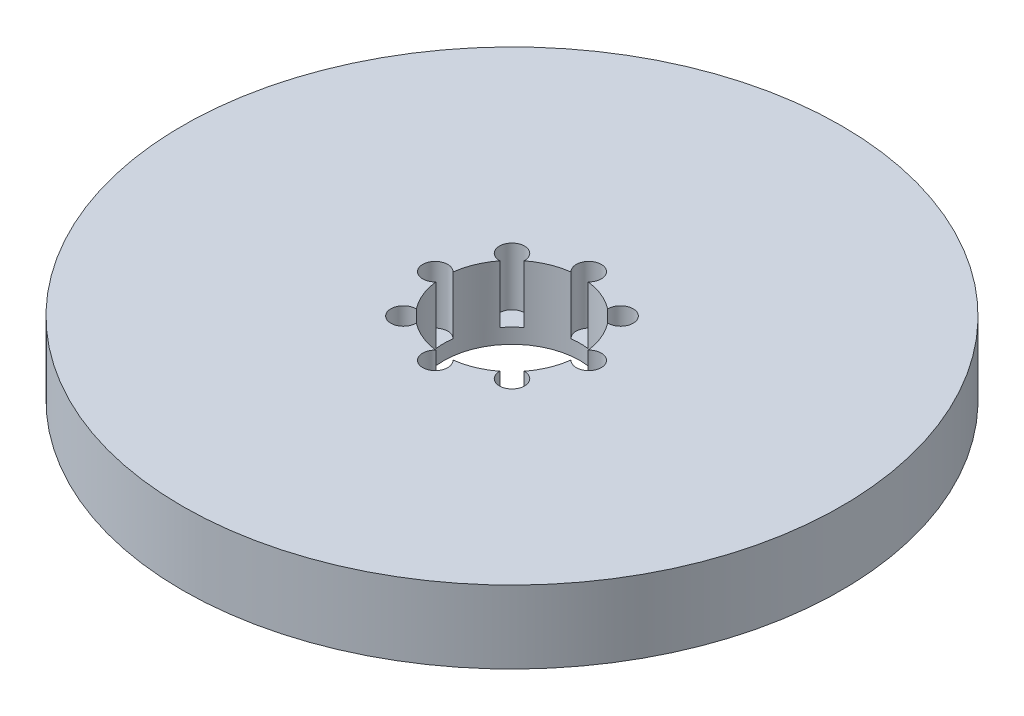
ISO-10303-21;
HEADER;
FILE_DESCRIPTION(('STEP AP214'),'2;1');
FILE_NAME('part.step','',(''),(''),'','','');
FILE_SCHEMA(('AUTOMOTIVE_DESIGN { 1 0 10303 214 1 1 1 1 }'));
ENDSEC;
DATA;
#1=APPLICATION_CONTEXT('core data for automotive mechanical design processes');
#2=APPLICATION_PROTOCOL_DEFINITION('international standard','automotive_design',2000,#1);
#3=PRODUCT_CONTEXT('',#1,'mechanical');
#4=PRODUCT('Part','Part','',(#3));
#5=PRODUCT_RELATED_PRODUCT_CATEGORY('part','',(#4));
#6=PRODUCT_DEFINITION_FORMATION('','',#4);
#7=PRODUCT_DEFINITION_CONTEXT('part definition',#1,'design');
#8=PRODUCT_DEFINITION('design','',#6,#7);
#9=PRODUCT_DEFINITION_SHAPE('','',#8);
#10=(LENGTH_UNIT() NAMED_UNIT(*) SI_UNIT(.MILLI.,.METRE.));
#11=(NAMED_UNIT(*) PLANE_ANGLE_UNIT() SI_UNIT($,.RADIAN.));
#12=(NAMED_UNIT(*) SI_UNIT($,.STERADIAN.) SOLID_ANGLE_UNIT());
#13=UNCERTAINTY_MEASURE_WITH_UNIT(LENGTH_MEASURE(1.E-05),#10,'distance_accuracy_value','');
#14=(GEOMETRIC_REPRESENTATION_CONTEXT(3) GLOBAL_UNCERTAINTY_ASSIGNED_CONTEXT((#13)) GLOBAL_UNIT_ASSIGNED_CONTEXT((#10,
#11,#12)) REPRESENTATION_CONTEXT('',''));
#15=CARTESIAN_POINT('',(0.,0.,0.));
#16=DIRECTION('',(0.,0.,1.));
#17=DIRECTION('',(1.,0.,0.));
#18=AXIS2_PLACEMENT_3D('',#15,#16,#17);
#19=CARTESIAN_POINT('',(0.,16.,0.));
#20=DIRECTION('',(0.,-1.,0.));
#21=DIRECTION('',(0.,0.,-1.));
#22=AXIS2_PLACEMENT_3D('',#19,#20,#21);
#23=CYLINDRICAL_SURFACE('',#22,72.5);
#24=CARTESIAN_POINT('',(0.,16.,0.));
#25=DIRECTION('',(0.,1.,0.));
#26=DIRECTION('',(0.,0.,1.));
#27=AXIS2_PLACEMENT_3D('',#24,#25,#26);
#28=CIRCLE('',#27,72.5);
#29=CARTESIAN_POINT('',(0.,16.,72.5));
#30=VERTEX_POINT('',#29);
#31=EDGE_CURVE('E195',#30,#30,#28,.T.);
#32=ORIENTED_EDGE('',*,*,#31,.F.);
#33=EDGE_LOOP('',(#32));
#34=FACE_BOUND('',#33,.T.);
#35=CARTESIAN_POINT('',(0.,0.,0.));
#36=DIRECTION('',(0.,1.,0.));
#37=DIRECTION('',(0.,0.,1.));
#38=AXIS2_PLACEMENT_3D('',#35,#36,#37);
#39=CIRCLE('',#38,72.5);
#40=CARTESIAN_POINT('',(0.,0.,72.5));
#41=VERTEX_POINT('',#40);
#42=EDGE_CURVE('E179',#41,#41,#39,.T.);
#43=ORIENTED_EDGE('',*,*,#42,.T.);
#44=EDGE_LOOP('',(#43));
#45=FACE_BOUND('',#44,.T.);
#46=ADVANCED_FACE('F39',(#34,#45),#23,.T.);
#47=CARTESIAN_POINT('',(0.,16.,0.));
#48=DIRECTION('',(0.,1.,0.));
#49=DIRECTION('',(0.,0.,1.));
#50=AXIS2_PLACEMENT_3D('',#47,#48,#49);
#51=PLANE('',#50);
#52=CARTESIAN_POINT('',(0.,16.,16.8964782712146));
#53=DIRECTION('',(0.,1.,0.));
#54=DIRECTION('',(1.,0.,0.));
#55=AXIS2_PLACEMENT_3D('',#52,#53,#54);
#56=CIRCLE('',#55,2.76567902574136);
#57=CARTESIAN_POINT('',(-1.89291587336263,16.,14.8800829801575));
#58=VERTEX_POINT('',#57);
#59=CARTESIAN_POINT('',(1.89291587336274,16.,14.8800829801574));
#60=VERTEX_POINT('',#59);
#61=EDGE_CURVE('E176',#58,#60,#56,.T.);
#62=ORIENTED_EDGE('',*,*,#61,.F.);
#63=CARTESIAN_POINT('',(0.,16.,0.));
#64=DIRECTION('',(0.,1.,0.));
#65=DIRECTION('',(0.,0.,1.));
#66=AXIS2_PLACEMENT_3D('',#63,#64,#65);
#67=CIRCLE('',#66,15.);
#68=CARTESIAN_POINT('',(-9.18331392961744,16.,11.8603012301583));
#69=VERTEX_POINT('',#68);
#70=EDGE_CURVE('E166',#69,#58,#67,.T.);
#71=ORIENTED_EDGE('',*,*,#70,.F.);
#72=CARTESIAN_POINT('',(-11.9476143637469,16.,11.947614363747));
#73=DIRECTION('',(0.,1.,0.));
#74=DIRECTION('',(0.707106781186549,0.,0.707106781186546));
#75=AXIS2_PLACEMENT_3D('',#72,#73,#74);
#76=CIRCLE('',#75,2.76567902574136);
#77=CARTESIAN_POINT('',(-11.8603012301583,16.,9.18331392961748));
#78=VERTEX_POINT('',#77);
#79=EDGE_CURVE('E147',#78,#69,#76,.T.);
#80=ORIENTED_EDGE('',*,*,#79,.F.);
#81=CARTESIAN_POINT('',(-14.8800829801575,16.,1.89291587336269));
#82=VERTEX_POINT('',#81);
#83=EDGE_CURVE('E180',#82,#78,#67,.T.);
#84=ORIENTED_EDGE('',*,*,#83,.F.);
#85=CARTESIAN_POINT('',(-16.8964782712146,16.,0.));
#86=DIRECTION('',(0.,1.,0.));
#87=DIRECTION('',(0.,0.,1.));
#88=AXIS2_PLACEMENT_3D('',#85,#86,#87);
#89=CIRCLE('',#88,2.76567902574136);
#90=CARTESIAN_POINT('',(-14.8800829801575,16.,-1.89291587336269));
#91=VERTEX_POINT('',#90);
#92=EDGE_CURVE('E186',#91,#82,#89,.T.);
#93=ORIENTED_EDGE('',*,*,#92,.F.);
#94=CARTESIAN_POINT('',(-11.8603012301584,16.,-9.18331392961731));
#95=VERTEX_POINT('',#94);
#96=EDGE_CURVE('E182',#95,#91,#67,.T.);
#97=ORIENTED_EDGE('',*,*,#96,.F.);
#98=CARTESIAN_POINT('',(-11.9476143637471,16.,-11.9476143637468));
#99=DIRECTION('',(0.,1.,0.));
#100=DIRECTION('',(-0.707106781186539,0.,0.707106781186556));
#101=AXIS2_PLACEMENT_3D('',#98,#99,#100);
#102=CIRCLE('',#101,2.76567902574136);
#103=CARTESIAN_POINT('',(-9.1833139296176,16.,-11.8603012301582));
#104=VERTEX_POINT('',#103);
#105=EDGE_CURVE('E446',#104,#95,#102,.T.);
#106=ORIENTED_EDGE('',*,*,#105,.F.);
#107=CARTESIAN_POINT('',(-1.89291587336284,16.,-14.8800829801574));
#108=VERTEX_POINT('',#107);
#109=EDGE_CURVE('E452',#108,#104,#67,.T.);
#110=ORIENTED_EDGE('',*,*,#109,.F.);
#111=CARTESIAN_POINT('',(-1.76981215728342E-13,16.,-16.8964782712146));
#112=DIRECTION('',(0.,1.,0.));
#113=DIRECTION('',(-1.,0.,0.));
#114=AXIS2_PLACEMENT_3D('',#111,#112,#113);
#115=CIRCLE('',#114,2.76567902574136);
#116=CARTESIAN_POINT('',(1.89291587336253,16.,-14.8800829801575));
#117=VERTEX_POINT('',#116);
#118=EDGE_CURVE('E477',#117,#108,#115,.T.);
#119=ORIENTED_EDGE('',*,*,#118,.F.);
#120=CARTESIAN_POINT('',(9.18331392961735,16.,-11.8603012301584));
#121=VERTEX_POINT('',#120);
#122=EDGE_CURVE('E460',#121,#117,#67,.T.);
#123=ORIENTED_EDGE('',*,*,#122,.F.);
#124=CARTESIAN_POINT('',(11.9476143637469,16.,-11.9476143637471));
#125=DIRECTION('',(0.,1.,0.));
#126=DIRECTION('',(-0.707106781186554,0.,-0.707106781186541));
#127=AXIS2_PLACEMENT_3D('',#124,#125,#126);
#128=CIRCLE('',#127,2.76567902574136);
#129=CARTESIAN_POINT('',(11.8603012301582,16.,-9.18331392961756));
#130=VERTEX_POINT('',#129);
#131=EDGE_CURVE('E464',#130,#121,#128,.T.);
#132=ORIENTED_EDGE('',*,*,#131,.F.);
#133=CARTESIAN_POINT('',(14.8800829801575,16.,-1.89291587336269));
#134=VERTEX_POINT('',#133);
#135=EDGE_CURVE('E459',#134,#130,#67,.T.);
#136=ORIENTED_EDGE('',*,*,#135,.F.);
#137=CARTESIAN_POINT('',(16.8964782712146,16.,0.));
#138=DIRECTION('',(0.,1.,0.));
#139=DIRECTION('',(0.,0.,-1.));
#140=AXIS2_PLACEMENT_3D('',#137,#138,#139);
#141=CIRCLE('',#140,2.76567902574136);
#142=CARTESIAN_POINT('',(14.8800829801575,16.,1.89291587336269));
#143=VERTEX_POINT('',#142);
#144=EDGE_CURVE('E469',#143,#134,#141,.T.);
#145=ORIENTED_EDGE('',*,*,#144,.F.);
#146=CARTESIAN_POINT('',(11.8603012301583,16.,9.18331392961739));
#147=VERTEX_POINT('',#146);
#148=EDGE_CURVE('E181',#147,#143,#67,.T.);
#149=ORIENTED_EDGE('',*,*,#148,.F.);
#150=CARTESIAN_POINT('',(11.947614363747,16.,11.9476143637469));
#151=DIRECTION('',(0.,1.,0.));
#152=DIRECTION('',(0.707106781186544,0.,-0.707106781186551));
#153=AXIS2_PLACEMENT_3D('',#150,#151,#152);
#154=CIRCLE('',#153,2.76567902574136);
#155=CARTESIAN_POINT('',(9.18331392961752,16.,11.8603012301582));
#156=VERTEX_POINT('',#155);
#157=EDGE_CURVE('E475',#156,#147,#154,.T.);
#158=ORIENTED_EDGE('',*,*,#157,.F.);
#159=EDGE_CURVE('E177',#60,#156,#67,.T.);
#160=ORIENTED_EDGE('',*,*,#159,.F.);
#161=EDGE_LOOP('',(#62,#71,#80,#84,#93,#97,#106,#110,#119,#123,#132,#136,#145,#149,#158,#160));
#162=FACE_BOUND('',#161,.T.);
#163=ORIENTED_EDGE('',*,*,#31,.T.);
#164=EDGE_LOOP('',(#163));
#165=FACE_BOUND('',#164,.T.);
#166=ADVANCED_FACE('F172',(#162,#165),#51,.T.);
#167=CARTESIAN_POINT('',(0.,0.,0.));
#168=DIRECTION('',(0.,1.,0.));
#169=DIRECTION('',(0.,0.,1.));
#170=AXIS2_PLACEMENT_3D('',#167,#168,#169);
#171=PLANE('',#170);
#172=CARTESIAN_POINT('',(0.,0.,0.));
#173=DIRECTION('',(0.,1.,0.));
#174=DIRECTION('',(0.,0.,1.));
#175=AXIS2_PLACEMENT_3D('',#172,#173,#174);
#176=CIRCLE('',#175,15.);
#177=CARTESIAN_POINT('',(0.,0.,15.));
#178=VERTEX_POINT('',#177);
#179=EDGE_CURVE('E187',#178,#178,#176,.T.);
#180=ORIENTED_EDGE('',*,*,#179,.T.);
#181=EDGE_LOOP('',(#180));
#182=FACE_BOUND('',#181,.T.);
#183=ORIENTED_EDGE('',*,*,#42,.F.);
#184=EDGE_LOOP('',(#183));
#185=FACE_BOUND('',#184,.T.);
#186=ADVANCED_FACE('F270',(#182,#185),#171,.F.);
#187=CARTESIAN_POINT('',(0.,16.,0.));
#188=DIRECTION('',(0.,-1.,0.));
#189=DIRECTION('',(0.,0.,-1.));
#190=AXIS2_PLACEMENT_3D('',#187,#188,#189);
#191=CYLINDRICAL_SURFACE('',#190,15.);
#192=DIRECTION('',(0.,1.,0.));
#193=VECTOR('',#192,1.);
#194=CARTESIAN_POINT('',(-1.89291587336264,9.64415360905631,14.8800829801575));
#195=LINE('',#194,#193);
#196=CARTESIAN_POINT('',(-1.89291587336263,3.28830721811261,14.8800829801575));
#197=VERTEX_POINT('',#196);
#198=EDGE_CURVE('E11',#197,#58,#195,.T.);
#199=ORIENTED_EDGE('',*,*,#198,.F.);
#200=CARTESIAN_POINT('',(0.,3.28830721811261,0.));
#201=DIRECTION('',(0.,1.,0.));
#202=DIRECTION('',(0.,0.,1.));
#203=AXIS2_PLACEMENT_3D('',#200,#201,#202);
#204=CIRCLE('',#203,15.);
#205=CARTESIAN_POINT('',(1.89291587336274,3.28830721811261,14.8800829801574));
#206=VERTEX_POINT('',#205);
#207=EDGE_CURVE('E250',#197,#206,#204,.T.);
#208=ORIENTED_EDGE('',*,*,#207,.T.);
#209=DIRECTION('',(0.,1.,0.));
#210=VECTOR('',#209,1.);
#211=CARTESIAN_POINT('',(1.89291587336274,9.64415360905631,14.8800829801575));
#212=LINE('',#211,#210);
#213=EDGE_CURVE('E46',#60,#206,#212,.F.);
#214=ORIENTED_EDGE('',*,*,#213,.F.);
#215=ORIENTED_EDGE('',*,*,#159,.T.);
#216=DIRECTION('',(0.,1.,0.));
#217=VECTOR('',#216,1.);
#218=CARTESIAN_POINT('',(9.18331392961752,9.64415360905631,11.8603012301582));
#219=LINE('',#218,#217);
#220=CARTESIAN_POINT('',(9.18331392961752,3.28830721811261,11.8603012301582));
#221=VERTEX_POINT('',#220);
#222=EDGE_CURVE('E244',#221,#156,#219,.T.);
#223=ORIENTED_EDGE('',*,*,#222,.F.);
#224=CARTESIAN_POINT('',(0.,3.28830721811261,0.));
#225=DIRECTION('',(0.,1.,0.));
#226=DIRECTION('',(0.,0.,1.));
#227=AXIS2_PLACEMENT_3D('',#224,#225,#226);
#228=CIRCLE('',#227,15.);
#229=CARTESIAN_POINT('',(11.8603012301583,3.28830721811261,9.18331392961739));
#230=VERTEX_POINT('',#229);
#231=EDGE_CURVE('E238',#221,#230,#228,.T.);
#232=ORIENTED_EDGE('',*,*,#231,.T.);
#233=DIRECTION('',(0.,1.,0.));
#234=VECTOR('',#233,1.);
#235=CARTESIAN_POINT('',(11.8603012301583,9.64415360905631,9.18331392961739));
#236=LINE('',#235,#234);
#237=EDGE_CURVE('E242',#147,#230,#236,.F.);
#238=ORIENTED_EDGE('',*,*,#237,.F.);
#239=ORIENTED_EDGE('',*,*,#148,.T.);
#240=DIRECTION('',(0.,1.,0.));
#241=VECTOR('',#240,1.);
#242=CARTESIAN_POINT('',(14.8800829801575,9.64415360905631,1.89291587336269));
#243=LINE('',#242,#241);
#244=CARTESIAN_POINT('',(14.8800829801575,3.28830721811261,1.89291587336269));
#245=VERTEX_POINT('',#244);
#246=EDGE_CURVE('E236',#245,#143,#243,.T.);
#247=ORIENTED_EDGE('',*,*,#246,.F.);
#248=CARTESIAN_POINT('',(0.,3.28830721811261,0.));
#249=DIRECTION('',(0.,1.,0.));
#250=DIRECTION('',(0.,0.,1.));
#251=AXIS2_PLACEMENT_3D('',#248,#249,#250);
#252=CIRCLE('',#251,15.);
#253=CARTESIAN_POINT('',(14.8800829801575,3.28830721811261,-1.89291587336269));
#254=VERTEX_POINT('',#253);
#255=EDGE_CURVE('E235',#245,#254,#252,.T.);
#256=ORIENTED_EDGE('',*,*,#255,.T.);
#257=DIRECTION('',(0.,1.,0.));
#258=VECTOR('',#257,1.);
#259=CARTESIAN_POINT('',(14.8800829801575,9.64415360905631,-1.89291587336269));
#260=LINE('',#259,#258);
#261=EDGE_CURVE('E234',#134,#254,#260,.F.);
#262=ORIENTED_EDGE('',*,*,#261,.F.);
#263=ORIENTED_EDGE('',*,*,#135,.T.);
#264=DIRECTION('',(0.,1.,0.));
#265=VECTOR('',#264,1.);
#266=CARTESIAN_POINT('',(11.8603012301582,9.64415360905631,-9.18331392961756));
#267=LINE('',#266,#265);
#268=CARTESIAN_POINT('',(11.8603012301582,3.28830721811261,-9.18331392961756));
#269=VERTEX_POINT('',#268);
#270=EDGE_CURVE('E229',#269,#130,#267,.T.);
#271=ORIENTED_EDGE('',*,*,#270,.F.);
#272=CARTESIAN_POINT('',(0.,3.28830721811261,0.));
#273=DIRECTION('',(0.,1.,0.));
#274=DIRECTION('',(0.,0.,1.));
#275=AXIS2_PLACEMENT_3D('',#272,#273,#274);
#276=CIRCLE('',#275,15.);
#277=CARTESIAN_POINT('',(9.18331392961735,3.28830721811261,-11.8603012301584));
#278=VERTEX_POINT('',#277);
#279=EDGE_CURVE('E221',#269,#278,#276,.T.);
#280=ORIENTED_EDGE('',*,*,#279,.T.);
#281=DIRECTION('',(0.,1.,0.));
#282=VECTOR('',#281,1.);
#283=CARTESIAN_POINT('',(9.18331392961735,9.64415360905631,-11.8603012301584));
#284=LINE('',#283,#282);
#285=EDGE_CURVE('E230',#121,#278,#284,.F.);
#286=ORIENTED_EDGE('',*,*,#285,.F.);
#287=ORIENTED_EDGE('',*,*,#122,.T.);
#288=DIRECTION('',(0.,1.,0.));
#289=VECTOR('',#288,1.);
#290=CARTESIAN_POINT('',(1.89291587336254,9.64415360905631,-14.8800829801575));
#291=LINE('',#290,#289);
#292=CARTESIAN_POINT('',(1.89291587336253,3.28830721811261,-14.8800829801575));
#293=VERTEX_POINT('',#292);
#294=EDGE_CURVE('E225',#293,#117,#291,.T.);
#295=ORIENTED_EDGE('',*,*,#294,.F.);
#296=CARTESIAN_POINT('',(0.,3.28830721811261,0.));
#297=DIRECTION('',(0.,1.,0.));
#298=DIRECTION('',(0.,0.,1.));
#299=AXIS2_PLACEMENT_3D('',#296,#297,#298);
#300=CIRCLE('',#299,15.);
#301=CARTESIAN_POINT('',(-1.89291587336284,3.28830721811261,-14.8800829801574));
#302=VERTEX_POINT('',#301);
#303=EDGE_CURVE('E216',#293,#302,#300,.T.);
#304=ORIENTED_EDGE('',*,*,#303,.T.);
#305=DIRECTION('',(0.,1.,0.));
#306=VECTOR('',#305,1.);
#307=CARTESIAN_POINT('',(-1.89291587336285,9.64415360905631,-14.8800829801574));
#308=LINE('',#307,#306);
#309=EDGE_CURVE('E218',#108,#302,#308,.F.);
#310=ORIENTED_EDGE('',*,*,#309,.F.);
#311=ORIENTED_EDGE('',*,*,#109,.T.);
#312=DIRECTION('',(0.,1.,0.));
#313=VECTOR('',#312,1.);
#314=CARTESIAN_POINT('',(-9.1833139296176,9.64415360905631,-11.8603012301582));
#315=LINE('',#314,#313);
#316=CARTESIAN_POINT('',(-9.1833139296176,3.28830721811261,-11.8603012301582));
#317=VERTEX_POINT('',#316);
#318=EDGE_CURVE('E212',#317,#104,#315,.T.);
#319=ORIENTED_EDGE('',*,*,#318,.F.);
#320=CARTESIAN_POINT('',(0.,3.28830721811261,0.));
#321=DIRECTION('',(0.,1.,0.));
#322=DIRECTION('',(0.,0.,1.));
#323=AXIS2_PLACEMENT_3D('',#320,#321,#322);
#324=CIRCLE('',#323,15.);
#325=CARTESIAN_POINT('',(-11.8603012301584,3.28830721811261,-9.18331392961731));
#326=VERTEX_POINT('',#325);
#327=EDGE_CURVE('E208',#317,#326,#324,.T.);
#328=ORIENTED_EDGE('',*,*,#327,.T.);
#329=DIRECTION('',(0.,1.,0.));
#330=VECTOR('',#329,1.);
#331=CARTESIAN_POINT('',(-11.8603012301584,9.64415360905631,-9.18331392961731));
#332=LINE('',#331,#330);
#333=EDGE_CURVE('E211',#95,#326,#332,.F.);
#334=ORIENTED_EDGE('',*,*,#333,.F.);
#335=ORIENTED_EDGE('',*,*,#96,.T.);
#336=DIRECTION('',(0.,1.,0.));
#337=VECTOR('',#336,1.);
#338=CARTESIAN_POINT('',(-14.8800829801575,9.64415360905631,-1.89291587336269));
#339=LINE('',#338,#337);
#340=CARTESIAN_POINT('',(-14.8800829801575,3.28830721811261,-1.89291587336269));
#341=VERTEX_POINT('',#340);
#342=EDGE_CURVE('E201',#341,#91,#339,.T.);
#343=ORIENTED_EDGE('',*,*,#342,.F.);
#344=CARTESIAN_POINT('',(0.,3.28830721811261,0.));
#345=DIRECTION('',(0.,1.,0.));
#346=DIRECTION('',(0.,0.,1.));
#347=AXIS2_PLACEMENT_3D('',#344,#345,#346);
#348=CIRCLE('',#347,15.);
#349=CARTESIAN_POINT('',(-14.8800829801575,3.28830721811261,1.89291587336269));
#350=VERTEX_POINT('',#349);
#351=EDGE_CURVE('E194',#341,#350,#348,.T.);
#352=ORIENTED_EDGE('',*,*,#351,.T.);
#353=DIRECTION('',(0.,1.,0.));
#354=VECTOR('',#353,1.);
#355=CARTESIAN_POINT('',(-14.8800829801575,9.64415360905631,1.89291587336269));
#356=LINE('',#355,#354);
#357=EDGE_CURVE('E199',#82,#350,#356,.F.);
#358=ORIENTED_EDGE('',*,*,#357,.F.);
#359=ORIENTED_EDGE('',*,*,#83,.T.);
#360=DIRECTION('',(0.,1.,0.));
#361=VECTOR('',#360,1.);
#362=CARTESIAN_POINT('',(-11.8603012301583,9.64415360905631,9.18331392961748));
#363=LINE('',#362,#361);
#364=CARTESIAN_POINT('',(-11.8603012301583,3.28830721811261,9.18331392961748));
#365=VERTEX_POINT('',#364);
#366=EDGE_CURVE('E160',#365,#78,#363,.T.);
#367=ORIENTED_EDGE('',*,*,#366,.F.);
#368=CARTESIAN_POINT('',(0.,3.28830721811261,0.));
#369=DIRECTION('',(0.,1.,0.));
#370=DIRECTION('',(0.,0.,1.));
#371=AXIS2_PLACEMENT_3D('',#368,#369,#370);
#372=CIRCLE('',#371,15.);
#373=CARTESIAN_POINT('',(-9.18331392961744,3.28830721811261,11.8603012301583));
#374=VERTEX_POINT('',#373);
#375=EDGE_CURVE('E168',#365,#374,#372,.T.);
#376=ORIENTED_EDGE('',*,*,#375,.T.);
#377=DIRECTION('',(0.,1.,0.));
#378=VECTOR('',#377,1.);
#379=CARTESIAN_POINT('',(-9.18331392961744,9.64415360905631,11.8603012301583));
#380=LINE('',#379,#378);
#381=EDGE_CURVE('E152',#69,#374,#380,.F.);
#382=ORIENTED_EDGE('',*,*,#381,.F.);
#383=ORIENTED_EDGE('',*,*,#70,.T.);
#384=EDGE_LOOP('',(#199,#208,#214,#215,#223,#232,#238,#239,#247,#256,#262,#263,#271,#280,#286,
#287,#295,#304,#310,#311,#319,#328,#334,#335,#343,#352,#358,#359,#367,#376,#382,#383));
#385=FACE_BOUND('',#384,.T.);
#386=ORIENTED_EDGE('',*,*,#179,.F.);
#387=EDGE_LOOP('',(#386));
#388=FACE_BOUND('',#387,.T.);
#389=ADVANCED_FACE('F170',(#385,#388),#191,.F.);
#390=CARTESIAN_POINT('',(-16.8964782712146,3.28830721811261,0.));
#391=DIRECTION('',(0.,1.,0.));
#392=DIRECTION('',(0.,0.,1.));
#393=AXIS2_PLACEMENT_3D('',#390,#391,#392);
#394=CYLINDRICAL_SURFACE('',#393,2.76567902574136);
#395=ORIENTED_EDGE('',*,*,#342,.T.);
#396=ORIENTED_EDGE('',*,*,#92,.T.);
#397=ORIENTED_EDGE('',*,*,#357,.T.);
#398=CARTESIAN_POINT('',(-16.8964782712146,3.28830721811261,0.));
#399=DIRECTION('',(0.,1.,0.));
#400=DIRECTION('',(0.,0.,1.));
#401=AXIS2_PLACEMENT_3D('',#398,#399,#400);
#402=CIRCLE('',#401,2.76567902574136);
#403=EDGE_CURVE('E191',#341,#350,#402,.T.);
#404=ORIENTED_EDGE('',*,*,#403,.F.);
#405=EDGE_LOOP('',(#395,#396,#397,#404));
#406=FACE_BOUND('',#405,.T.);
#407=ADVANCED_FACE('F279',(#406),#394,.F.);
#408=CARTESIAN_POINT('',(-16.8964782712146,3.28830721811261,0.));
#409=DIRECTION('',(0.,1.,0.));
#410=DIRECTION('',(0.,0.,1.));
#411=AXIS2_PLACEMENT_3D('',#408,#409,#410);
#412=PLANE('',#411);
#413=ORIENTED_EDGE('',*,*,#403,.T.);
#414=ORIENTED_EDGE('',*,*,#351,.F.);
#415=EDGE_LOOP('',(#413,#414));
#416=FACE_BOUND('',#415,.T.);
#417=ADVANCED_FACE('F285',(#416),#412,.T.);
#418=CARTESIAN_POINT('',(-11.9476143637469,3.28830721811261,11.947614363747));
#419=DIRECTION('',(0.,1.,0.));
#420=DIRECTION('',(0.,0.,1.));
#421=AXIS2_PLACEMENT_3D('',#418,#419,#420);
#422=CYLINDRICAL_SURFACE('',#421,2.76567902574136);
#423=ORIENTED_EDGE('',*,*,#366,.T.);
#424=ORIENTED_EDGE('',*,*,#79,.T.);
#425=ORIENTED_EDGE('',*,*,#381,.T.);
#426=CARTESIAN_POINT('',(-11.9476143637469,3.28830721811261,11.947614363747));
#427=DIRECTION('',(0.,1.,0.));
#428=DIRECTION('',(0.707106781186549,0.,0.707106781186546));
#429=AXIS2_PLACEMENT_3D('',#426,#427,#428);
#430=CIRCLE('',#429,2.76567902574136);
#431=EDGE_CURVE('E165',#365,#374,#430,.T.);
#432=ORIENTED_EDGE('',*,*,#431,.F.);
#433=EDGE_LOOP('',(#423,#424,#425,#432));
#434=FACE_BOUND('',#433,.T.);
#435=ADVANCED_FACE('F155',(#434),#422,.F.);
#436=CARTESIAN_POINT('',(-11.9476143637469,3.28830721811261,11.947614363747));
#437=DIRECTION('',(0.,1.,0.));
#438=DIRECTION('',(0.707106781186549,0.,0.707106781186546));
#439=AXIS2_PLACEMENT_3D('',#436,#437,#438);
#440=PLANE('',#439);
#441=ORIENTED_EDGE('',*,*,#431,.T.);
#442=ORIENTED_EDGE('',*,*,#375,.F.);
#443=EDGE_LOOP('',(#441,#442));
#444=FACE_BOUND('',#443,.T.);
#445=ADVANCED_FACE('F288',(#444),#440,.T.);
#446=CARTESIAN_POINT('',(-11.9476143637471,3.28830721811261,-11.9476143637468));
#447=DIRECTION('',(0.,1.,0.));
#448=DIRECTION('',(0.,0.,1.));
#449=AXIS2_PLACEMENT_3D('',#446,#447,#448);
#450=CYLINDRICAL_SURFACE('',#449,2.76567902574136);
#451=ORIENTED_EDGE('',*,*,#318,.T.);
#452=ORIENTED_EDGE('',*,*,#105,.T.);
#453=ORIENTED_EDGE('',*,*,#333,.T.);
#454=CARTESIAN_POINT('',(-11.9476143637471,3.28830721811261,-11.9476143637468));
#455=DIRECTION('',(0.,1.,0.));
#456=DIRECTION('',(-0.707106781186539,0.,0.707106781186556));
#457=AXIS2_PLACEMENT_3D('',#454,#455,#456);
#458=CIRCLE('',#457,2.76567902574136);
#459=EDGE_CURVE('E447',#317,#326,#458,.T.);
#460=ORIENTED_EDGE('',*,*,#459,.F.);
#461=EDGE_LOOP('',(#451,#452,#453,#460));
#462=FACE_BOUND('',#461,.T.);
#463=ADVANCED_FACE('F295',(#462),#450,.F.);
#464=CARTESIAN_POINT('',(-11.9476143637471,3.28830721811261,-11.9476143637468));
#465=DIRECTION('',(0.,1.,0.));
#466=DIRECTION('',(-0.707106781186539,0.,0.707106781186556));
#467=AXIS2_PLACEMENT_3D('',#464,#465,#466);
#468=PLANE('',#467);
#469=ORIENTED_EDGE('',*,*,#459,.T.);
#470=ORIENTED_EDGE('',*,*,#327,.F.);
#471=EDGE_LOOP('',(#469,#470));
#472=FACE_BOUND('',#471,.T.);
#473=ADVANCED_FACE('F375',(#472),#468,.T.);
#474=CARTESIAN_POINT('',(-1.76981215728342E-13,3.28830721811261,-16.8964782712146));
#475=DIRECTION('',(0.,1.,0.));
#476=DIRECTION('',(0.,0.,1.));
#477=AXIS2_PLACEMENT_3D('',#474,#475,#476);
#478=CYLINDRICAL_SURFACE('',#477,2.76567902574136);
#479=ORIENTED_EDGE('',*,*,#294,.T.);
#480=ORIENTED_EDGE('',*,*,#118,.T.);
#481=ORIENTED_EDGE('',*,*,#309,.T.);
#482=CARTESIAN_POINT('',(-1.76981215728342E-13,3.28830721811261,-16.8964782712146));
#483=DIRECTION('',(0.,1.,0.));
#484=DIRECTION('',(-1.,0.,0.));
#485=AXIS2_PLACEMENT_3D('',#482,#483,#484);
#486=CIRCLE('',#485,2.76567902574136);
#487=EDGE_CURVE('E467',#293,#302,#486,.T.);
#488=ORIENTED_EDGE('',*,*,#487,.F.);
#489=EDGE_LOOP('',(#479,#480,#481,#488));
#490=FACE_BOUND('',#489,.T.);
#491=ADVANCED_FACE('F361',(#490),#478,.F.);
#492=CARTESIAN_POINT('',(-1.76981215728342E-13,3.28830721811261,-16.8964782712146));
#493=DIRECTION('',(0.,1.,0.));
#494=DIRECTION('',(-1.,0.,0.));
#495=AXIS2_PLACEMENT_3D('',#492,#493,#494);
#496=PLANE('',#495);
#497=ORIENTED_EDGE('',*,*,#487,.T.);
#498=ORIENTED_EDGE('',*,*,#303,.F.);
#499=EDGE_LOOP('',(#497,#498));
#500=FACE_BOUND('',#499,.T.);
#501=ADVANCED_FACE('F297',(#500),#496,.T.);
#502=CARTESIAN_POINT('',(11.9476143637469,3.28830721811261,-11.9476143637471));
#503=DIRECTION('',(0.,1.,0.));
#504=DIRECTION('',(0.,0.,1.));
#505=AXIS2_PLACEMENT_3D('',#502,#503,#504);
#506=CYLINDRICAL_SURFACE('',#505,2.76567902574136);
#507=ORIENTED_EDGE('',*,*,#270,.T.);
#508=ORIENTED_EDGE('',*,*,#131,.T.);
#509=ORIENTED_EDGE('',*,*,#285,.T.);
#510=CARTESIAN_POINT('',(11.9476143637469,3.28830721811261,-11.9476143637471));
#511=DIRECTION('',(0.,1.,0.));
#512=DIRECTION('',(-0.707106781186554,0.,-0.707106781186541));
#513=AXIS2_PLACEMENT_3D('',#510,#511,#512);
#514=CIRCLE('',#513,2.76567902574136);
#515=EDGE_CURVE('E470',#269,#278,#514,.T.);
#516=ORIENTED_EDGE('',*,*,#515,.F.);
#517=EDGE_LOOP('',(#507,#508,#509,#516));
#518=FACE_BOUND('',#517,.T.);
#519=ADVANCED_FACE('F294',(#518),#506,.F.);
#520=CARTESIAN_POINT('',(11.9476143637469,3.28830721811261,-11.9476143637471));
#521=DIRECTION('',(0.,1.,0.));
#522=DIRECTION('',(-0.707106781186554,0.,-0.707106781186541));
#523=AXIS2_PLACEMENT_3D('',#520,#521,#522);
#524=PLANE('',#523);
#525=ORIENTED_EDGE('',*,*,#515,.T.);
#526=ORIENTED_EDGE('',*,*,#279,.F.);
#527=EDGE_LOOP('',(#525,#526));
#528=FACE_BOUND('',#527,.T.);
#529=ADVANCED_FACE('F300',(#528),#524,.T.);
#530=CARTESIAN_POINT('',(16.8964782712146,3.28830721811261,0.));
#531=DIRECTION('',(0.,1.,0.));
#532=DIRECTION('',(0.,0.,1.));
#533=AXIS2_PLACEMENT_3D('',#530,#531,#532);
#534=CYLINDRICAL_SURFACE('',#533,2.76567902574136);
#535=ORIENTED_EDGE('',*,*,#246,.T.);
#536=ORIENTED_EDGE('',*,*,#144,.T.);
#537=ORIENTED_EDGE('',*,*,#261,.T.);
#538=CARTESIAN_POINT('',(16.8964782712146,3.28830721811261,0.));
#539=DIRECTION('',(0.,1.,0.));
#540=DIRECTION('',(0.,0.,-1.));
#541=AXIS2_PLACEMENT_3D('',#538,#539,#540);
#542=CIRCLE('',#541,2.76567902574136);
#543=EDGE_CURVE('E472',#245,#254,#542,.T.);
#544=ORIENTED_EDGE('',*,*,#543,.F.);
#545=EDGE_LOOP('',(#535,#536,#537,#544));
#546=FACE_BOUND('',#545,.T.);
#547=ADVANCED_FACE('F305',(#546),#534,.F.);
#548=CARTESIAN_POINT('',(16.8964782712146,3.28830721811261,0.));
#549=DIRECTION('',(0.,1.,0.));
#550=DIRECTION('',(0.,0.,-1.));
#551=AXIS2_PLACEMENT_3D('',#548,#549,#550);
#552=PLANE('',#551);
#553=ORIENTED_EDGE('',*,*,#543,.T.);
#554=ORIENTED_EDGE('',*,*,#255,.F.);
#555=EDGE_LOOP('',(#553,#554));
#556=FACE_BOUND('',#555,.T.);
#557=ADVANCED_FACE('F308',(#556),#552,.T.);
#558=CARTESIAN_POINT('',(11.947614363747,3.28830721811261,11.9476143637469));
#559=DIRECTION('',(0.,1.,0.));
#560=DIRECTION('',(0.,0.,1.));
#561=AXIS2_PLACEMENT_3D('',#558,#559,#560);
#562=CYLINDRICAL_SURFACE('',#561,2.76567902574136);
#563=ORIENTED_EDGE('',*,*,#222,.T.);
#564=ORIENTED_EDGE('',*,*,#157,.T.);
#565=ORIENTED_EDGE('',*,*,#237,.T.);
#566=CARTESIAN_POINT('',(11.947614363747,3.28830721811261,11.9476143637469));
#567=DIRECTION('',(0.,1.,0.));
#568=DIRECTION('',(0.707106781186544,0.,-0.707106781186551));
#569=AXIS2_PLACEMENT_3D('',#566,#567,#568);
#570=CIRCLE('',#569,2.76567902574136);
#571=EDGE_CURVE('E56',#221,#230,#570,.T.);
#572=ORIENTED_EDGE('',*,*,#571,.F.);
#573=EDGE_LOOP('',(#563,#564,#565,#572));
#574=FACE_BOUND('',#573,.T.);
#575=ADVANCED_FACE('F309',(#574),#562,.F.);
#576=CARTESIAN_POINT('',(11.947614363747,3.28830721811261,11.9476143637469));
#577=DIRECTION('',(0.,1.,0.));
#578=DIRECTION('',(0.707106781186544,0.,-0.707106781186551));
#579=AXIS2_PLACEMENT_3D('',#576,#577,#578);
#580=PLANE('',#579);
#581=ORIENTED_EDGE('',*,*,#571,.T.);
#582=ORIENTED_EDGE('',*,*,#231,.F.);
#583=EDGE_LOOP('',(#581,#582));
#584=FACE_BOUND('',#583,.T.);
#585=ADVANCED_FACE('F256',(#584),#580,.T.);
#586=CARTESIAN_POINT('',(0.,3.28830721811261,16.8964782712146));
#587=DIRECTION('',(0.,1.,0.));
#588=DIRECTION('',(0.,0.,1.));
#589=AXIS2_PLACEMENT_3D('',#586,#587,#588);
#590=CYLINDRICAL_SURFACE('',#589,2.76567902574136);
#591=ORIENTED_EDGE('',*,*,#198,.T.);
#592=ORIENTED_EDGE('',*,*,#61,.T.);
#593=ORIENTED_EDGE('',*,*,#213,.T.);
#594=CARTESIAN_POINT('',(0.,3.28830721811261,16.8964782712146));
#595=DIRECTION('',(0.,1.,0.));
#596=DIRECTION('',(1.,0.,0.));
#597=AXIS2_PLACEMENT_3D('',#594,#595,#596);
#598=CIRCLE('',#597,2.76567902574136);
#599=EDGE_CURVE('E55',#197,#206,#598,.T.);
#600=ORIENTED_EDGE('',*,*,#599,.F.);
#601=EDGE_LOOP('',(#591,#592,#593,#600));
#602=FACE_BOUND('',#601,.T.);
#603=ADVANCED_FACE('F253',(#602),#590,.F.);
#604=CARTESIAN_POINT('',(0.,3.28830721811261,16.8964782712146));
#605=DIRECTION('',(0.,1.,0.));
#606=DIRECTION('',(1.,0.,0.));
#607=AXIS2_PLACEMENT_3D('',#604,#605,#606);
#608=PLANE('',#607);
#609=ORIENTED_EDGE('',*,*,#599,.T.);
#610=ORIENTED_EDGE('',*,*,#207,.F.);
#611=EDGE_LOOP('',(#609,#610));
#612=FACE_BOUND('',#611,.T.);
#613=ADVANCED_FACE('F252',(#612),#608,.T.);
#614=CLOSED_SHELL('',(#46,#166,#186,#389,#407,#417,#435,#445,#463,#473,#491,#501,#519,#529,#547,
#557,#575,#585,#603,#613));
#615=MANIFOLD_SOLID_BREP('B2',#614);
#616=ADVANCED_BREP_SHAPE_REPRESENTATION('',(#18,#615),#14);
#617=SHAPE_DEFINITION_REPRESENTATION(#9,#616);
ENDSEC;
END-ISO-10303-21;
